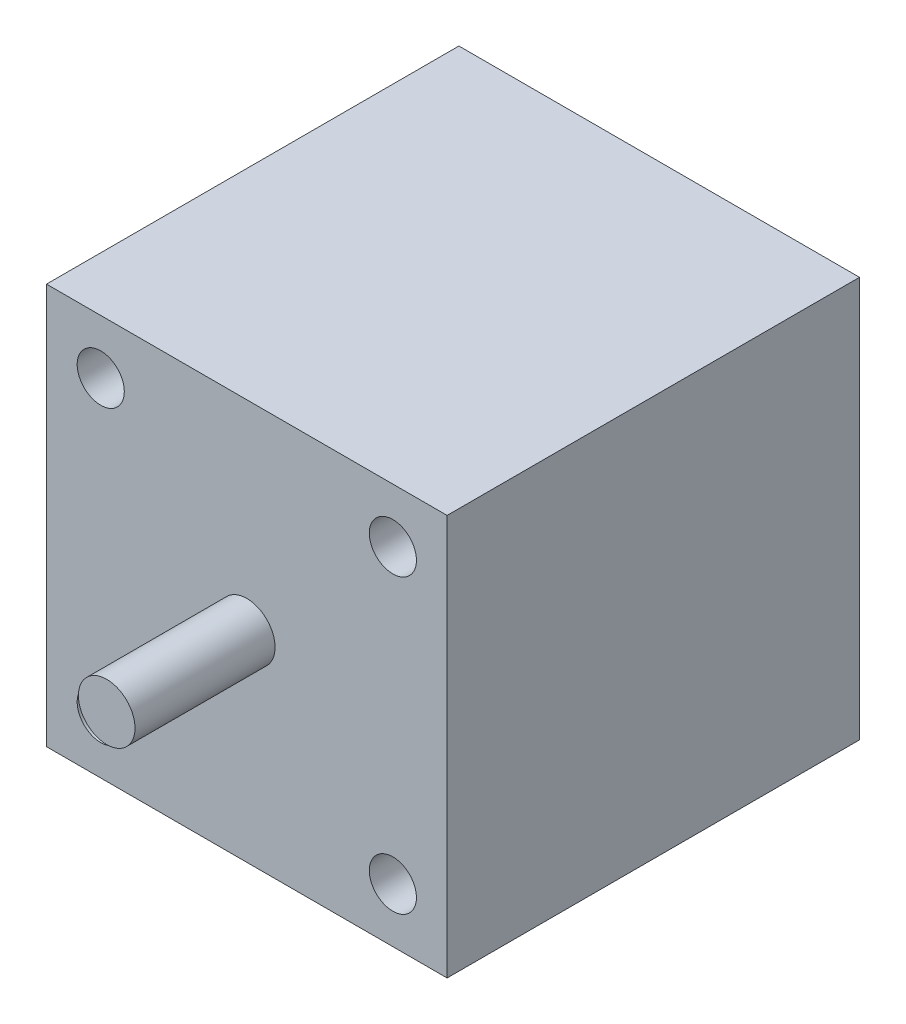
ISO-10303-21;
HEADER;
FILE_DESCRIPTION(('STEP AP214'),'2;1');
FILE_NAME('part.step','',(''),(''),'','','');
FILE_SCHEMA(('AUTOMOTIVE_DESIGN { 1 0 10303 214 1 1 1 1 }'));
ENDSEC;
DATA;
#1=APPLICATION_CONTEXT('core data for automotive mechanical design processes');
#2=APPLICATION_PROTOCOL_DEFINITION('international standard','automotive_design',2000,#1);
#3=PRODUCT_CONTEXT('',#1,'mechanical');
#4=PRODUCT('Part','Part','',(#3));
#5=PRODUCT_RELATED_PRODUCT_CATEGORY('part','',(#4));
#6=PRODUCT_DEFINITION_FORMATION('','',#4);
#7=PRODUCT_DEFINITION_CONTEXT('part definition',#1,'design');
#8=PRODUCT_DEFINITION('design','',#6,#7);
#9=PRODUCT_DEFINITION_SHAPE('','',#8);
#10=(LENGTH_UNIT() NAMED_UNIT(*) SI_UNIT(.MILLI.,.METRE.));
#11=(NAMED_UNIT(*) PLANE_ANGLE_UNIT() SI_UNIT($,.RADIAN.));
#12=(NAMED_UNIT(*) SI_UNIT($,.STERADIAN.) SOLID_ANGLE_UNIT());
#13=UNCERTAINTY_MEASURE_WITH_UNIT(LENGTH_MEASURE(1.E-05),#10,'distance_accuracy_value','');
#14=(GEOMETRIC_REPRESENTATION_CONTEXT(3) GLOBAL_UNCERTAINTY_ASSIGNED_CONTEXT((#13)) GLOBAL_UNIT_ASSIGNED_CONTEXT((#10,
#11,#12)) REPRESENTATION_CONTEXT('',''));
#15=CARTESIAN_POINT('',(0.,0.,0.));
#16=DIRECTION('',(0.,0.,1.));
#17=DIRECTION('',(1.,0.,0.));
#18=AXIS2_PLACEMENT_3D('',#15,#16,#17);
#19=CARTESIAN_POINT('',(21.25,-21.25,43.75));
#20=DIRECTION('',(-1.,0.,0.));
#21=DIRECTION('',(0.,0.,1.));
#22=AXIS2_PLACEMENT_3D('',#19,#20,#21);
#23=PLANE('',#22);
#24=DIRECTION('',(0.,1.,0.));
#25=VECTOR('',#24,1.);
#26=CARTESIAN_POINT('',(21.25,-21.25,0.));
#27=LINE('',#26,#25);
#28=CARTESIAN_POINT('',(21.25,-21.25,0.));
#29=VERTEX_POINT('',#28);
#30=CARTESIAN_POINT('',(21.25,21.25,0.));
#31=VERTEX_POINT('',#30);
#32=EDGE_CURVE('E107',#29,#31,#27,.T.);
#33=ORIENTED_EDGE('',*,*,#32,.T.);
#34=DIRECTION('',(0.,0.,-1.));
#35=VECTOR('',#34,1.);
#36=CARTESIAN_POINT('',(21.25,21.25,43.75));
#37=LINE('',#36,#35);
#38=CARTESIAN_POINT('',(21.25,21.25,43.75));
#39=VERTEX_POINT('',#38);
#40=EDGE_CURVE('E49',#39,#31,#37,.T.);
#41=ORIENTED_EDGE('',*,*,#40,.F.);
#42=DIRECTION('',(0.,1.,0.));
#43=VECTOR('',#42,1.);
#44=CARTESIAN_POINT('',(21.25,-21.25,43.75));
#45=LINE('',#44,#43);
#46=CARTESIAN_POINT('',(21.25,-21.25,43.75));
#47=VERTEX_POINT('',#46);
#48=EDGE_CURVE('E93',#47,#39,#45,.T.);
#49=ORIENTED_EDGE('',*,*,#48,.F.);
#50=DIRECTION('',(0.,0.,-1.));
#51=VECTOR('',#50,1.);
#52=CARTESIAN_POINT('',(21.25,-21.25,43.75));
#53=LINE('',#52,#51);
#54=EDGE_CURVE('E103',#47,#29,#53,.T.);
#55=ORIENTED_EDGE('',*,*,#54,.T.);
#56=EDGE_LOOP('',(#33,#41,#49,#55));
#57=FACE_BOUND('',#56,.T.);
#58=ADVANCED_FACE('F41',(#57),#23,.F.);
#59=CARTESIAN_POINT('',(-21.25,21.25,43.75));
#60=DIRECTION('',(0.,-1.,0.));
#61=DIRECTION('',(0.,0.,-1.));
#62=AXIS2_PLACEMENT_3D('',#59,#60,#61);
#63=PLANE('',#62);
#64=DIRECTION('',(-1.,0.,0.));
#65=VECTOR('',#64,1.);
#66=CARTESIAN_POINT('',(-21.25,21.25,0.));
#67=LINE('',#66,#65);
#68=CARTESIAN_POINT('',(-21.25,21.25,0.));
#69=VERTEX_POINT('',#68);
#70=EDGE_CURVE('E98',#31,#69,#67,.T.);
#71=ORIENTED_EDGE('',*,*,#70,.T.);
#72=DIRECTION('',(0.,0.,-1.));
#73=VECTOR('',#72,1.);
#74=CARTESIAN_POINT('',(-21.25,21.25,43.75));
#75=LINE('',#74,#73);
#76=CARTESIAN_POINT('',(-21.25,21.25,43.75));
#77=VERTEX_POINT('',#76);
#78=EDGE_CURVE('E96',#77,#69,#75,.T.);
#79=ORIENTED_EDGE('',*,*,#78,.F.);
#80=DIRECTION('',(-1.,0.,0.));
#81=VECTOR('',#80,1.);
#82=CARTESIAN_POINT('',(-21.25,21.25,43.75));
#83=LINE('',#82,#81);
#84=EDGE_CURVE('E88',#39,#77,#83,.T.);
#85=ORIENTED_EDGE('',*,*,#84,.F.);
#86=ORIENTED_EDGE('',*,*,#40,.T.);
#87=EDGE_LOOP('',(#71,#79,#85,#86));
#88=FACE_BOUND('',#87,.T.);
#89=ADVANCED_FACE('F97',(#88),#63,.F.);
#90=CARTESIAN_POINT('',(-21.25,-21.25,43.75));
#91=DIRECTION('',(1.,0.,0.));
#92=DIRECTION('',(0.,0.,-1.));
#93=AXIS2_PLACEMENT_3D('',#90,#91,#92);
#94=PLANE('',#93);
#95=DIRECTION('',(0.,-1.,0.));
#96=VECTOR('',#95,1.);
#97=CARTESIAN_POINT('',(-21.25,-21.25,0.));
#98=LINE('',#97,#96);
#99=CARTESIAN_POINT('',(-21.25,-21.25,0.));
#100=VERTEX_POINT('',#99);
#101=EDGE_CURVE('E74',#69,#100,#98,.T.);
#102=ORIENTED_EDGE('',*,*,#101,.T.);
#103=DIRECTION('',(0.,0.,-1.));
#104=VECTOR('',#103,1.);
#105=CARTESIAN_POINT('',(-21.25,-21.25,43.75));
#106=LINE('',#105,#104);
#107=CARTESIAN_POINT('',(-21.25,-21.25,43.75));
#108=VERTEX_POINT('',#107);
#109=EDGE_CURVE('E99',#108,#100,#106,.T.);
#110=ORIENTED_EDGE('',*,*,#109,.F.);
#111=DIRECTION('',(0.,-1.,0.));
#112=VECTOR('',#111,1.);
#113=CARTESIAN_POINT('',(-21.25,-21.25,43.75));
#114=LINE('',#113,#112);
#115=EDGE_CURVE('E91',#77,#108,#114,.T.);
#116=ORIENTED_EDGE('',*,*,#115,.F.);
#117=ORIENTED_EDGE('',*,*,#78,.T.);
#118=EDGE_LOOP('',(#102,#110,#116,#117));
#119=FACE_BOUND('',#118,.T.);
#120=ADVANCED_FACE('F101',(#119),#94,.F.);
#121=CARTESIAN_POINT('',(-21.25,-21.25,43.75));
#122=DIRECTION('',(0.,1.,0.));
#123=DIRECTION('',(0.,0.,1.));
#124=AXIS2_PLACEMENT_3D('',#121,#122,#123);
#125=PLANE('',#124);
#126=DIRECTION('',(1.,0.,0.));
#127=VECTOR('',#126,1.);
#128=CARTESIAN_POINT('',(-21.25,-21.25,0.));
#129=LINE('',#128,#127);
#130=EDGE_CURVE('E80',#100,#29,#129,.T.);
#131=ORIENTED_EDGE('',*,*,#130,.T.);
#132=ORIENTED_EDGE('',*,*,#54,.F.);
#133=DIRECTION('',(1.,0.,0.));
#134=VECTOR('',#133,1.);
#135=CARTESIAN_POINT('',(-21.25,-21.25,43.75));
#136=LINE('',#135,#134);
#137=EDGE_CURVE('E57',#108,#47,#136,.T.);
#138=ORIENTED_EDGE('',*,*,#137,.F.);
#139=ORIENTED_EDGE('',*,*,#109,.T.);
#140=EDGE_LOOP('',(#131,#132,#138,#139));
#141=FACE_BOUND('',#140,.T.);
#142=ADVANCED_FACE('F129',(#141),#125,.F.);
#143=CARTESIAN_POINT('',(0.,0.,43.75));
#144=DIRECTION('',(0.,0.,-1.));
#145=DIRECTION('',(-1.,0.,0.));
#146=AXIS2_PLACEMENT_3D('',#143,#144,#145);
#147=PLANE('',#146);
#148=CARTESIAN_POINT('',(0.,0.,43.75));
#149=DIRECTION('',(0.,0.,-1.));
#150=DIRECTION('',(-1.,0.,0.));
#151=AXIS2_PLACEMENT_3D('',#148,#149,#150);
#152=CIRCLE('',#151,3.);
#153=CARTESIAN_POINT('',(-3.,0.,43.75));
#154=VERTEX_POINT('',#153);
#155=EDGE_CURVE('E11',#154,#154,#152,.F.);
#156=ORIENTED_EDGE('',*,*,#155,.F.);
#157=EDGE_LOOP('',(#156));
#158=FACE_BOUND('',#157,.T.);
#159=CARTESIAN_POINT('',(-15.495,-15.495,43.75));
#160=DIRECTION('',(0.,0.,1.));
#161=DIRECTION('',(1.,0.,0.));
#162=AXIS2_PLACEMENT_3D('',#159,#160,#161);
#163=CIRCLE('',#162,2.5);
#164=CARTESIAN_POINT('',(-12.995,-15.495,43.75));
#165=VERTEX_POINT('',#164);
#166=EDGE_CURVE('E217',#165,#165,#163,.T.);
#167=ORIENTED_EDGE('',*,*,#166,.F.);
#168=EDGE_LOOP('',(#167));
#169=FACE_BOUND('',#168,.T.);
#170=CARTESIAN_POINT('',(15.495,-15.495,43.75));
#171=DIRECTION('',(0.,0.,1.));
#172=DIRECTION('',(1.,0.,0.));
#173=AXIS2_PLACEMENT_3D('',#170,#171,#172);
#174=CIRCLE('',#173,2.5);
#175=CARTESIAN_POINT('',(17.995,-15.495,43.75));
#176=VERTEX_POINT('',#175);
#177=EDGE_CURVE('E224',#176,#176,#174,.T.);
#178=ORIENTED_EDGE('',*,*,#177,.F.);
#179=EDGE_LOOP('',(#178));
#180=FACE_BOUND('',#179,.T.);
#181=CARTESIAN_POINT('',(15.495,15.495,43.75));
#182=DIRECTION('',(0.,0.,1.));
#183=DIRECTION('',(1.,0.,0.));
#184=AXIS2_PLACEMENT_3D('',#181,#182,#183);
#185=CIRCLE('',#184,2.5);
#186=CARTESIAN_POINT('',(17.995,15.495,43.75));
#187=VERTEX_POINT('',#186);
#188=EDGE_CURVE('E230',#187,#187,#185,.T.);
#189=ORIENTED_EDGE('',*,*,#188,.F.);
#190=EDGE_LOOP('',(#189));
#191=FACE_BOUND('',#190,.T.);
#192=CARTESIAN_POINT('',(-15.495,15.495,43.75));
#193=DIRECTION('',(0.,0.,1.));
#194=DIRECTION('',(1.,0.,0.));
#195=AXIS2_PLACEMENT_3D('',#192,#193,#194);
#196=CIRCLE('',#195,2.5);
#197=CARTESIAN_POINT('',(-12.995,15.495,43.75));
#198=VERTEX_POINT('',#197);
#199=EDGE_CURVE('E211',#198,#198,#196,.T.);
#200=ORIENTED_EDGE('',*,*,#199,.F.);
#201=EDGE_LOOP('',(#200));
#202=FACE_BOUND('',#201,.T.);
#203=ORIENTED_EDGE('',*,*,#48,.T.);
#204=ORIENTED_EDGE('',*,*,#84,.T.);
#205=ORIENTED_EDGE('',*,*,#115,.T.);
#206=ORIENTED_EDGE('',*,*,#137,.T.);
#207=EDGE_LOOP('',(#203,#204,#205,#206));
#208=FACE_BOUND('',#207,.T.);
#209=ADVANCED_FACE('F89',(#158,#169,#180,#191,#202,#208),#147,.F.);
#210=CARTESIAN_POINT('',(0.,0.,0.));
#211=DIRECTION('',(0.,0.,-1.));
#212=DIRECTION('',(-1.,0.,0.));
#213=AXIS2_PLACEMENT_3D('',#210,#211,#212);
#214=PLANE('',#213);
#215=ORIENTED_EDGE('',*,*,#32,.F.);
#216=ORIENTED_EDGE('',*,*,#130,.F.);
#217=ORIENTED_EDGE('',*,*,#101,.F.);
#218=ORIENTED_EDGE('',*,*,#70,.F.);
#219=EDGE_LOOP('',(#215,#216,#217,#218));
#220=FACE_BOUND('',#219,.T.);
#221=ADVANCED_FACE('F118',(#220),#214,.T.);
#222=CARTESIAN_POINT('',(-15.495,15.495,38.75));
#223=DIRECTION('',(0.,0.,1.));
#224=DIRECTION('',(1.,0.,0.));
#225=AXIS2_PLACEMENT_3D('',#222,#223,#224);
#226=CYLINDRICAL_SURFACE('',#225,2.5);
#227=CARTESIAN_POINT('',(-15.495,15.495,38.75));
#228=DIRECTION('',(0.,0.,1.));
#229=DIRECTION('',(1.,0.,0.));
#230=AXIS2_PLACEMENT_3D('',#227,#228,#229);
#231=CIRCLE('',#230,2.5);
#232=CARTESIAN_POINT('',(-12.995,15.495,38.75));
#233=VERTEX_POINT('',#232);
#234=EDGE_CURVE('E110',#233,#233,#231,.T.);
#235=ORIENTED_EDGE('',*,*,#234,.F.);
#236=EDGE_LOOP('',(#235));
#237=FACE_BOUND('',#236,.T.);
#238=ORIENTED_EDGE('',*,*,#199,.T.);
#239=EDGE_LOOP('',(#238));
#240=FACE_BOUND('',#239,.T.);
#241=ADVANCED_FACE('F120',(#237,#240),#226,.F.);
#242=CARTESIAN_POINT('',(-15.495,15.495,38.75));
#243=DIRECTION('',(0.,0.,1.));
#244=DIRECTION('',(1.,0.,0.));
#245=AXIS2_PLACEMENT_3D('',#242,#243,#244);
#246=PLANE('',#245);
#247=ORIENTED_EDGE('',*,*,#234,.T.);
#248=EDGE_LOOP('',(#247));
#249=FACE_BOUND('',#248,.T.);
#250=ADVANCED_FACE('F126',(#249),#246,.T.);
#251=CARTESIAN_POINT('',(15.495,15.495,38.75));
#252=DIRECTION('',(0.,0.,1.));
#253=DIRECTION('',(1.,0.,0.));
#254=AXIS2_PLACEMENT_3D('',#251,#252,#253);
#255=CYLINDRICAL_SURFACE('',#254,2.5);
#256=CARTESIAN_POINT('',(15.495,15.495,38.75));
#257=DIRECTION('',(0.,0.,1.));
#258=DIRECTION('',(1.,0.,0.));
#259=AXIS2_PLACEMENT_3D('',#256,#257,#258);
#260=CIRCLE('',#259,2.5);
#261=CARTESIAN_POINT('',(17.995,15.495,38.75));
#262=VERTEX_POINT('',#261);
#263=EDGE_CURVE('E214',#262,#262,#260,.T.);
#264=ORIENTED_EDGE('',*,*,#263,.F.);
#265=EDGE_LOOP('',(#264));
#266=FACE_BOUND('',#265,.T.);
#267=ORIENTED_EDGE('',*,*,#188,.T.);
#268=EDGE_LOOP('',(#267));
#269=FACE_BOUND('',#268,.T.);
#270=ADVANCED_FACE('F187',(#266,#269),#255,.F.);
#271=CARTESIAN_POINT('',(15.495,15.495,38.75));
#272=DIRECTION('',(0.,0.,1.));
#273=DIRECTION('',(1.,0.,0.));
#274=AXIS2_PLACEMENT_3D('',#271,#272,#273);
#275=PLANE('',#274);
#276=ORIENTED_EDGE('',*,*,#263,.T.);
#277=EDGE_LOOP('',(#276));
#278=FACE_BOUND('',#277,.T.);
#279=ADVANCED_FACE('F183',(#278),#275,.T.);
#280=CARTESIAN_POINT('',(15.495,-15.495,38.75));
#281=DIRECTION('',(0.,0.,1.));
#282=DIRECTION('',(1.,0.,0.));
#283=AXIS2_PLACEMENT_3D('',#280,#281,#282);
#284=CYLINDRICAL_SURFACE('',#283,2.5);
#285=CARTESIAN_POINT('',(15.495,-15.495,38.75));
#286=DIRECTION('',(0.,0.,1.));
#287=DIRECTION('',(1.,0.,0.));
#288=AXIS2_PLACEMENT_3D('',#285,#286,#287);
#289=CIRCLE('',#288,2.5);
#290=CARTESIAN_POINT('',(17.995,-15.495,38.75));
#291=VERTEX_POINT('',#290);
#292=EDGE_CURVE('E227',#291,#291,#289,.T.);
#293=ORIENTED_EDGE('',*,*,#292,.F.);
#294=EDGE_LOOP('',(#293));
#295=FACE_BOUND('',#294,.T.);
#296=ORIENTED_EDGE('',*,*,#177,.T.);
#297=EDGE_LOOP('',(#296));
#298=FACE_BOUND('',#297,.T.);
#299=ADVANCED_FACE('F186',(#295,#298),#284,.F.);
#300=CARTESIAN_POINT('',(15.495,-15.495,38.75));
#301=DIRECTION('',(0.,0.,1.));
#302=DIRECTION('',(1.,0.,0.));
#303=AXIS2_PLACEMENT_3D('',#300,#301,#302);
#304=PLANE('',#303);
#305=ORIENTED_EDGE('',*,*,#292,.T.);
#306=EDGE_LOOP('',(#305));
#307=FACE_BOUND('',#306,.T.);
#308=ADVANCED_FACE('F192',(#307),#304,.T.);
#309=CARTESIAN_POINT('',(-15.495,-15.495,38.75));
#310=DIRECTION('',(0.,0.,1.));
#311=DIRECTION('',(1.,0.,0.));
#312=AXIS2_PLACEMENT_3D('',#309,#310,#311);
#313=CYLINDRICAL_SURFACE('',#312,2.5);
#314=CARTESIAN_POINT('',(-15.495,-15.495,38.75));
#315=DIRECTION('',(0.,0.,1.));
#316=DIRECTION('',(1.,0.,0.));
#317=AXIS2_PLACEMENT_3D('',#314,#315,#316);
#318=CIRCLE('',#317,2.5);
#319=CARTESIAN_POINT('',(-12.995,-15.495,38.75));
#320=VERTEX_POINT('',#319);
#321=EDGE_CURVE('E220',#320,#320,#318,.T.);
#322=ORIENTED_EDGE('',*,*,#321,.F.);
#323=EDGE_LOOP('',(#322));
#324=FACE_BOUND('',#323,.T.);
#325=ORIENTED_EDGE('',*,*,#166,.T.);
#326=EDGE_LOOP('',(#325));
#327=FACE_BOUND('',#326,.T.);
#328=ADVANCED_FACE('F195',(#324,#327),#313,.F.);
#329=CARTESIAN_POINT('',(-15.495,-15.495,38.75));
#330=DIRECTION('',(0.,0.,1.));
#331=DIRECTION('',(1.,0.,0.));
#332=AXIS2_PLACEMENT_3D('',#329,#330,#331);
#333=PLANE('',#332);
#334=ORIENTED_EDGE('',*,*,#321,.T.);
#335=EDGE_LOOP('',(#334));
#336=FACE_BOUND('',#335,.T.);
#337=ADVANCED_FACE('F157',(#336),#333,.T.);
#338=CARTESIAN_POINT('',(0.,0.,58.61));
#339=DIRECTION('',(0.,0.,-1.));
#340=DIRECTION('',(-1.,0.,0.));
#341=AXIS2_PLACEMENT_3D('',#338,#339,#340);
#342=CYLINDRICAL_SURFACE('',#341,3.);
#343=CARTESIAN_POINT('',(0.,0.,58.61));
#344=DIRECTION('',(0.,0.,1.));
#345=DIRECTION('',(1.,0.,0.));
#346=AXIS2_PLACEMENT_3D('',#343,#344,#345);
#347=CIRCLE('',#346,3.);
#348=CARTESIAN_POINT('',(3.,0.,58.61));
#349=VERTEX_POINT('',#348);
#350=EDGE_CURVE('E221',#349,#349,#347,.T.);
#351=ORIENTED_EDGE('',*,*,#350,.F.);
#352=EDGE_LOOP('',(#351));
#353=FACE_BOUND('',#352,.T.);
#354=ORIENTED_EDGE('',*,*,#155,.T.);
#355=EDGE_LOOP('',(#354));
#356=FACE_BOUND('',#355,.T.);
#357=ADVANCED_FACE('F162',(#353,#356),#342,.T.);
#358=CARTESIAN_POINT('',(0.,0.,58.61));
#359=DIRECTION('',(0.,0.,1.));
#360=DIRECTION('',(1.,0.,0.));
#361=AXIS2_PLACEMENT_3D('',#358,#359,#360);
#362=PLANE('',#361);
#363=ORIENTED_EDGE('',*,*,#350,.T.);
#364=EDGE_LOOP('',(#363));
#365=FACE_BOUND('',#364,.T.);
#366=ADVANCED_FACE('F167',(#365),#362,.T.);
#367=CLOSED_SHELL('',(#58,#89,#120,#142,#209,#221,#241,#250,#270,#279,#299,#308,#328,#337,#357,#366));
#368=MANIFOLD_SOLID_BREP('B2',#367);
#369=ADVANCED_BREP_SHAPE_REPRESENTATION('',(#18,#368),#14);
#370=SHAPE_DEFINITION_REPRESENTATION(#9,#369);
ENDSEC;
END-ISO-10303-21;
